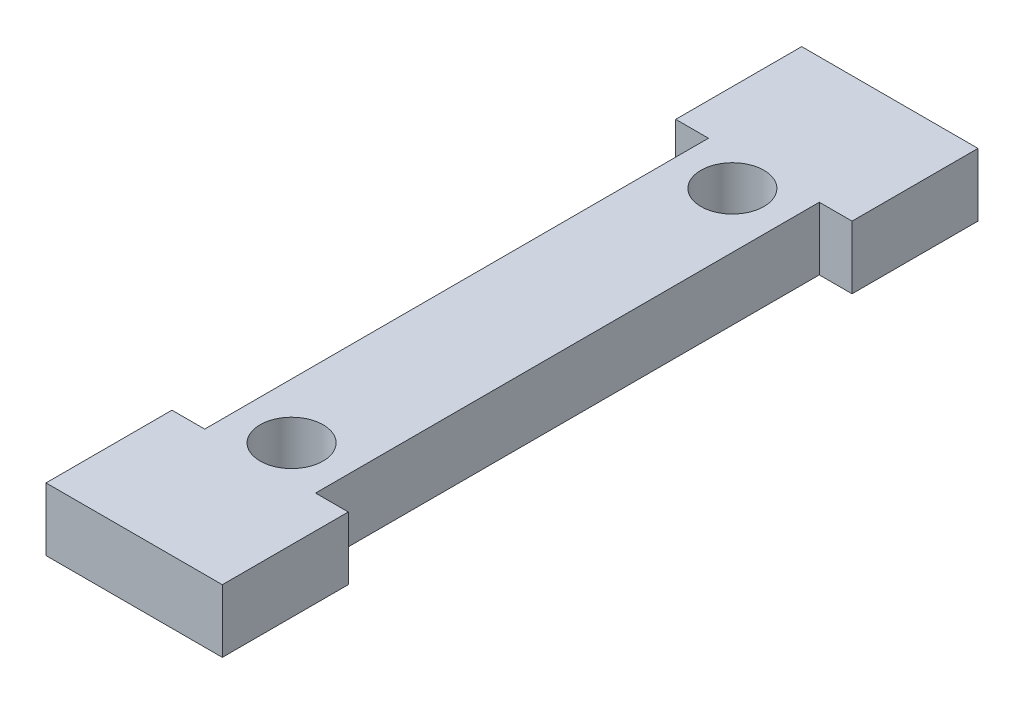
ISO-10303-21;
HEADER;
FILE_DESCRIPTION(('STEP AP214'),'2;1');
FILE_NAME('part.step','',(''),(''),'','','');
FILE_SCHEMA(('AUTOMOTIVE_DESIGN { 1 0 10303 214 1 1 1 1 }'));
ENDSEC;
DATA;
#1=APPLICATION_CONTEXT('core data for automotive mechanical design processes');
#2=APPLICATION_PROTOCOL_DEFINITION('international standard','automotive_design',2000,#1);
#3=PRODUCT_CONTEXT('',#1,'mechanical');
#4=PRODUCT('Part','Part','',(#3));
#5=PRODUCT_RELATED_PRODUCT_CATEGORY('part','',(#4));
#6=PRODUCT_DEFINITION_FORMATION('','',#4);
#7=PRODUCT_DEFINITION_CONTEXT('part definition',#1,'design');
#8=PRODUCT_DEFINITION('design','',#6,#7);
#9=PRODUCT_DEFINITION_SHAPE('','',#8);
#10=(LENGTH_UNIT() NAMED_UNIT(*) SI_UNIT(.MILLI.,.METRE.));
#11=(NAMED_UNIT(*) PLANE_ANGLE_UNIT() SI_UNIT($,.RADIAN.));
#12=(NAMED_UNIT(*) SI_UNIT($,.STERADIAN.) SOLID_ANGLE_UNIT());
#13=UNCERTAINTY_MEASURE_WITH_UNIT(LENGTH_MEASURE(1.E-05),#10,'distance_accuracy_value','');
#14=(GEOMETRIC_REPRESENTATION_CONTEXT(3) GLOBAL_UNCERTAINTY_ASSIGNED_CONTEXT((#13)) GLOBAL_UNIT_ASSIGNED_CONTEXT((#10,
#11,#12)) REPRESENTATION_CONTEXT('',''));
#15=CARTESIAN_POINT('',(0.,0.,0.));
#16=DIRECTION('',(0.,0.,1.));
#17=DIRECTION('',(1.,0.,0.));
#18=AXIS2_PLACEMENT_3D('',#15,#16,#17);
#19=CARTESIAN_POINT('',(0.,6.35,0.));
#20=DIRECTION('',(0.,0.,-1.));
#21=DIRECTION('',(-1.,0.,0.));
#22=AXIS2_PLACEMENT_3D('',#19,#20,#21);
#23=PLANE('',#22);
#24=DIRECTION('',(1.,0.,0.));
#25=VECTOR('',#24,1.);
#26=CARTESIAN_POINT('',(0.,0.,0.));
#27=LINE('',#26,#25);
#28=CARTESIAN_POINT('',(-3.30199999999999,0.,0.));
#29=VERTEX_POINT('',#28);
#30=CARTESIAN_POINT('',(14.478,0.,0.));
#31=VERTEX_POINT('',#30);
#32=EDGE_CURVE('E173',#29,#31,#27,.T.);
#33=ORIENTED_EDGE('',*,*,#32,.T.);
#34=DIRECTION('',(0.,-1.,0.));
#35=VECTOR('',#34,1.);
#36=CARTESIAN_POINT('',(14.478,6.35,0.));
#37=LINE('',#36,#35);
#38=CARTESIAN_POINT('',(14.478,6.35,0.));
#39=VERTEX_POINT('',#38);
#40=EDGE_CURVE('E11',#39,#31,#37,.T.);
#41=ORIENTED_EDGE('',*,*,#40,.F.);
#42=DIRECTION('',(1.,0.,0.));
#43=VECTOR('',#42,1.);
#44=CARTESIAN_POINT('',(0.,6.35,0.));
#45=LINE('',#44,#43);
#46=CARTESIAN_POINT('',(-3.30199999999999,6.35,0.));
#47=VERTEX_POINT('',#46);
#48=EDGE_CURVE('E266',#47,#39,#45,.T.);
#49=ORIENTED_EDGE('',*,*,#48,.F.);
#50=DIRECTION('',(0.,-1.,0.));
#51=VECTOR('',#50,1.);
#52=CARTESIAN_POINT('',(-3.30199999999999,6.35,0.));
#53=LINE('',#52,#51);
#54=EDGE_CURVE('E169',#47,#29,#53,.T.);
#55=ORIENTED_EDGE('',*,*,#54,.T.);
#56=EDGE_LOOP('',(#33,#41,#49,#55));
#57=FACE_BOUND('',#56,.T.);
#58=ADVANCED_FACE('F45',(#57),#23,.F.);
#59=CARTESIAN_POINT('',(14.478,6.35,0.));
#60=DIRECTION('',(-1.,0.,0.));
#61=DIRECTION('',(0.,0.,1.));
#62=AXIS2_PLACEMENT_3D('',#59,#60,#61);
#63=PLANE('',#62);
#64=DIRECTION('',(0.,0.,-1.));
#65=VECTOR('',#64,1.);
#66=CARTESIAN_POINT('',(14.478,0.,0.));
#67=LINE('',#66,#65);
#68=CARTESIAN_POINT('',(14.478,0.,-12.7));
#69=VERTEX_POINT('',#68);
#70=EDGE_CURVE('E176',#31,#69,#67,.T.);
#71=ORIENTED_EDGE('',*,*,#70,.T.);
#72=DIRECTION('',(0.,-1.,0.));
#73=VECTOR('',#72,1.);
#74=CARTESIAN_POINT('',(14.478,6.35,-12.7));
#75=LINE('',#74,#73);
#76=CARTESIAN_POINT('',(14.478,6.35,-12.7));
#77=VERTEX_POINT('',#76);
#78=EDGE_CURVE('E54',#77,#69,#75,.T.);
#79=ORIENTED_EDGE('',*,*,#78,.F.);
#80=DIRECTION('',(0.,0.,-1.));
#81=VECTOR('',#80,1.);
#82=CARTESIAN_POINT('',(14.478,6.35,0.));
#83=LINE('',#82,#81);
#84=EDGE_CURVE('E117',#39,#77,#83,.T.);
#85=ORIENTED_EDGE('',*,*,#84,.F.);
#86=ORIENTED_EDGE('',*,*,#40,.T.);
#87=EDGE_LOOP('',(#71,#79,#85,#86));
#88=FACE_BOUND('',#87,.T.);
#89=ADVANCED_FACE('F279',(#88),#63,.F.);
#90=CARTESIAN_POINT('',(0.,6.35,-12.7));
#91=DIRECTION('',(0.,0.,1.));
#92=DIRECTION('',(1.,0.,0.));
#93=AXIS2_PLACEMENT_3D('',#90,#91,#92);
#94=PLANE('',#93);
#95=DIRECTION('',(-1.,0.,0.));
#96=VECTOR('',#95,1.);
#97=CARTESIAN_POINT('',(0.,0.,-12.7));
#98=LINE('',#97,#96);
#99=CARTESIAN_POINT('',(11.176,0.,-12.7));
#100=VERTEX_POINT('',#99);
#101=EDGE_CURVE('E178',#69,#100,#98,.T.);
#102=ORIENTED_EDGE('',*,*,#101,.T.);
#103=DIRECTION('',(0.,-1.,0.));
#104=VECTOR('',#103,1.);
#105=CARTESIAN_POINT('',(11.176,6.35,-12.7));
#106=LINE('',#105,#104);
#107=CARTESIAN_POINT('',(11.176,6.35,-12.7));
#108=VERTEX_POINT('',#107);
#109=EDGE_CURVE('E217',#108,#100,#106,.T.);
#110=ORIENTED_EDGE('',*,*,#109,.F.);
#111=DIRECTION('',(-1.,0.,0.));
#112=VECTOR('',#111,1.);
#113=CARTESIAN_POINT('',(0.,6.35,-12.7));
#114=LINE('',#113,#112);
#115=EDGE_CURVE('E225',#77,#108,#114,.T.);
#116=ORIENTED_EDGE('',*,*,#115,.F.);
#117=ORIENTED_EDGE('',*,*,#78,.T.);
#118=EDGE_LOOP('',(#102,#110,#116,#117));
#119=FACE_BOUND('',#118,.T.);
#120=ADVANCED_FACE('F223',(#119),#94,.F.);
#121=CARTESIAN_POINT('',(11.176,6.35,0.));
#122=DIRECTION('',(-1.,0.,0.));
#123=DIRECTION('',(0.,0.,1.));
#124=AXIS2_PLACEMENT_3D('',#121,#122,#123);
#125=PLANE('',#124);
#126=DIRECTION('',(0.,0.,-1.));
#127=VECTOR('',#126,1.);
#128=CARTESIAN_POINT('',(11.176,0.,0.));
#129=LINE('',#128,#127);
#130=CARTESIAN_POINT('',(11.176,0.,-63.5));
#131=VERTEX_POINT('',#130);
#132=EDGE_CURVE('E180',#100,#131,#129,.T.);
#133=ORIENTED_EDGE('',*,*,#132,.T.);
#134=DIRECTION('',(0.,-1.,0.));
#135=VECTOR('',#134,1.);
#136=CARTESIAN_POINT('',(11.176,6.35,-63.5));
#137=LINE('',#136,#135);
#138=CARTESIAN_POINT('',(11.176,6.35,-63.5));
#139=VERTEX_POINT('',#138);
#140=EDGE_CURVE('E214',#139,#131,#137,.T.);
#141=ORIENTED_EDGE('',*,*,#140,.F.);
#142=DIRECTION('',(0.,0.,-1.));
#143=VECTOR('',#142,1.);
#144=CARTESIAN_POINT('',(11.176,6.35,0.));
#145=LINE('',#144,#143);
#146=EDGE_CURVE('E244',#108,#139,#145,.T.);
#147=ORIENTED_EDGE('',*,*,#146,.F.);
#148=ORIENTED_EDGE('',*,*,#109,.T.);
#149=EDGE_LOOP('',(#133,#141,#147,#148));
#150=FACE_BOUND('',#149,.T.);
#151=ADVANCED_FACE('F235',(#150),#125,.F.);
#152=CARTESIAN_POINT('',(0.,6.35,-63.5));
#153=DIRECTION('',(0.,0.,-1.));
#154=DIRECTION('',(-1.,0.,0.));
#155=AXIS2_PLACEMENT_3D('',#152,#153,#154);
#156=PLANE('',#155);
#157=DIRECTION('',(1.,0.,0.));
#158=VECTOR('',#157,1.);
#159=CARTESIAN_POINT('',(0.,0.,-63.5));
#160=LINE('',#159,#158);
#161=CARTESIAN_POINT('',(14.478,0.,-63.5));
#162=VERTEX_POINT('',#161);
#163=EDGE_CURVE('E182',#131,#162,#160,.T.);
#164=ORIENTED_EDGE('',*,*,#163,.T.);
#165=DIRECTION('',(0.,-1.,0.));
#166=VECTOR('',#165,1.);
#167=CARTESIAN_POINT('',(14.478,6.35,-63.5));
#168=LINE('',#167,#166);
#169=CARTESIAN_POINT('',(14.478,6.35,-63.5));
#170=VERTEX_POINT('',#169);
#171=EDGE_CURVE('E211',#170,#162,#168,.T.);
#172=ORIENTED_EDGE('',*,*,#171,.F.);
#173=DIRECTION('',(1.,0.,0.));
#174=VECTOR('',#173,1.);
#175=CARTESIAN_POINT('',(0.,6.35,-63.5));
#176=LINE('',#175,#174);
#177=EDGE_CURVE('E241',#139,#170,#176,.T.);
#178=ORIENTED_EDGE('',*,*,#177,.F.);
#179=ORIENTED_EDGE('',*,*,#140,.T.);
#180=EDGE_LOOP('',(#164,#172,#178,#179));
#181=FACE_BOUND('',#180,.T.);
#182=ADVANCED_FACE('F239',(#181),#156,.F.);
#183=CARTESIAN_POINT('',(14.478,6.35,0.));
#184=DIRECTION('',(-1.,0.,0.));
#185=DIRECTION('',(0.,0.,1.));
#186=AXIS2_PLACEMENT_3D('',#183,#184,#185);
#187=PLANE('',#186);
#188=DIRECTION('',(0.,0.,-1.));
#189=VECTOR('',#188,1.);
#190=CARTESIAN_POINT('',(14.478,0.,0.));
#191=LINE('',#190,#189);
#192=CARTESIAN_POINT('',(14.478,0.,-76.2));
#193=VERTEX_POINT('',#192);
#194=EDGE_CURVE('E184',#162,#193,#191,.T.);
#195=ORIENTED_EDGE('',*,*,#194,.T.);
#196=DIRECTION('',(0.,-1.,0.));
#197=VECTOR('',#196,1.);
#198=CARTESIAN_POINT('',(14.478,6.35,-76.2));
#199=LINE('',#198,#197);
#200=CARTESIAN_POINT('',(14.478,6.35,-76.2));
#201=VERTEX_POINT('',#200);
#202=EDGE_CURVE('E208',#201,#193,#199,.T.);
#203=ORIENTED_EDGE('',*,*,#202,.F.);
#204=DIRECTION('',(0.,0.,-1.));
#205=VECTOR('',#204,1.);
#206=CARTESIAN_POINT('',(14.478,6.35,0.));
#207=LINE('',#206,#205);
#208=EDGE_CURVE('E243',#170,#201,#207,.T.);
#209=ORIENTED_EDGE('',*,*,#208,.F.);
#210=ORIENTED_EDGE('',*,*,#171,.T.);
#211=EDGE_LOOP('',(#195,#203,#209,#210));
#212=FACE_BOUND('',#211,.T.);
#213=ADVANCED_FACE('F291',(#212),#187,.F.);
#214=CARTESIAN_POINT('',(0.,6.35,-76.2));
#215=DIRECTION('',(0.,0.,1.));
#216=DIRECTION('',(1.,0.,0.));
#217=AXIS2_PLACEMENT_3D('',#214,#215,#216);
#218=PLANE('',#217);
#219=DIRECTION('',(-1.,0.,0.));
#220=VECTOR('',#219,1.);
#221=CARTESIAN_POINT('',(0.,0.,-76.2));
#222=LINE('',#221,#220);
#223=CARTESIAN_POINT('',(-3.302,0.,-76.2));
#224=VERTEX_POINT('',#223);
#225=EDGE_CURVE('E186',#193,#224,#222,.T.);
#226=ORIENTED_EDGE('',*,*,#225,.T.);
#227=DIRECTION('',(0.,-1.,0.));
#228=VECTOR('',#227,1.);
#229=CARTESIAN_POINT('',(-3.302,6.35,-76.2));
#230=LINE('',#229,#228);
#231=CARTESIAN_POINT('',(-3.302,6.35,-76.2));
#232=VERTEX_POINT('',#231);
#233=EDGE_CURVE('E205',#232,#224,#230,.T.);
#234=ORIENTED_EDGE('',*,*,#233,.F.);
#235=DIRECTION('',(-1.,0.,0.));
#236=VECTOR('',#235,1.);
#237=CARTESIAN_POINT('',(0.,6.35,-76.2));
#238=LINE('',#237,#236);
#239=EDGE_CURVE('E246',#201,#232,#238,.T.);
#240=ORIENTED_EDGE('',*,*,#239,.F.);
#241=ORIENTED_EDGE('',*,*,#202,.T.);
#242=EDGE_LOOP('',(#226,#234,#240,#241));
#243=FACE_BOUND('',#242,.T.);
#244=ADVANCED_FACE('F294',(#243),#218,.F.);
#245=CARTESIAN_POINT('',(-3.30200000000001,6.35,0.));
#246=DIRECTION('',(1.,0.,0.));
#247=DIRECTION('',(0.,0.,-1.));
#248=AXIS2_PLACEMENT_3D('',#245,#246,#247);
#249=PLANE('',#248);
#250=DIRECTION('',(0.,0.,1.));
#251=VECTOR('',#250,1.);
#252=CARTESIAN_POINT('',(-3.30200000000001,0.,0.));
#253=LINE('',#252,#251);
#254=CARTESIAN_POINT('',(-3.302,0.,-63.5));
#255=VERTEX_POINT('',#254);
#256=EDGE_CURVE('E188',#224,#255,#253,.T.);
#257=ORIENTED_EDGE('',*,*,#256,.T.);
#258=DIRECTION('',(0.,-1.,0.));
#259=VECTOR('',#258,1.);
#260=CARTESIAN_POINT('',(-3.302,6.35,-63.5));
#261=LINE('',#260,#259);
#262=CARTESIAN_POINT('',(-3.302,6.35,-63.5));
#263=VERTEX_POINT('',#262);
#264=EDGE_CURVE('E202',#263,#255,#261,.T.);
#265=ORIENTED_EDGE('',*,*,#264,.F.);
#266=DIRECTION('',(0.,0.,1.));
#267=VECTOR('',#266,1.);
#268=CARTESIAN_POINT('',(-3.30200000000001,6.35,0.));
#269=LINE('',#268,#267);
#270=EDGE_CURVE('E252',#232,#263,#269,.T.);
#271=ORIENTED_EDGE('',*,*,#270,.F.);
#272=ORIENTED_EDGE('',*,*,#233,.T.);
#273=EDGE_LOOP('',(#257,#265,#271,#272));
#274=FACE_BOUND('',#273,.T.);
#275=ADVANCED_FACE('F258',(#274),#249,.F.);
#276=CARTESIAN_POINT('',(0.,6.35,-63.5));
#277=DIRECTION('',(0.,0.,-1.));
#278=DIRECTION('',(-1.,0.,0.));
#279=AXIS2_PLACEMENT_3D('',#276,#277,#278);
#280=PLANE('',#279);
#281=DIRECTION('',(1.,0.,0.));
#282=VECTOR('',#281,1.);
#283=CARTESIAN_POINT('',(0.,0.,-63.5));
#284=LINE('',#283,#282);
#285=CARTESIAN_POINT('',(0.,0.,-63.5));
#286=VERTEX_POINT('',#285);
#287=EDGE_CURVE('E190',#255,#286,#284,.T.);
#288=ORIENTED_EDGE('',*,*,#287,.T.);
#289=DIRECTION('',(0.,-1.,0.));
#290=VECTOR('',#289,1.);
#291=CARTESIAN_POINT('',(0.,6.35,-63.5));
#292=LINE('',#291,#290);
#293=CARTESIAN_POINT('',(0.,6.35,-63.5));
#294=VERTEX_POINT('',#293);
#295=EDGE_CURVE('E158',#294,#286,#292,.T.);
#296=ORIENTED_EDGE('',*,*,#295,.F.);
#297=DIRECTION('',(1.,0.,0.));
#298=VECTOR('',#297,1.);
#299=CARTESIAN_POINT('',(0.,6.35,-63.5));
#300=LINE('',#299,#298);
#301=EDGE_CURVE('E149',#263,#294,#300,.T.);
#302=ORIENTED_EDGE('',*,*,#301,.F.);
#303=ORIENTED_EDGE('',*,*,#264,.T.);
#304=EDGE_LOOP('',(#288,#296,#302,#303));
#305=FACE_BOUND('',#304,.T.);
#306=ADVANCED_FACE('F262',(#305),#280,.F.);
#307=CARTESIAN_POINT('',(0.,6.35,0.));
#308=DIRECTION('',(1.,0.,0.));
#309=DIRECTION('',(0.,0.,-1.));
#310=AXIS2_PLACEMENT_3D('',#307,#308,#309);
#311=PLANE('',#310);
#312=DIRECTION('',(0.,0.,1.));
#313=VECTOR('',#312,1.);
#314=CARTESIAN_POINT('',(0.,0.,0.));
#315=LINE('',#314,#313);
#316=CARTESIAN_POINT('',(0.,0.,-12.7));
#317=VERTEX_POINT('',#316);
#318=EDGE_CURVE('E157',#286,#317,#315,.T.);
#319=ORIENTED_EDGE('',*,*,#318,.T.);
#320=DIRECTION('',(0.,-1.,0.));
#321=VECTOR('',#320,1.);
#322=CARTESIAN_POINT('',(0.,6.35,-12.7));
#323=LINE('',#322,#321);
#324=CARTESIAN_POINT('',(0.,6.35,-12.7));
#325=VERTEX_POINT('',#324);
#326=EDGE_CURVE('E154',#325,#317,#323,.T.);
#327=ORIENTED_EDGE('',*,*,#326,.F.);
#328=DIRECTION('',(0.,0.,1.));
#329=VECTOR('',#328,1.);
#330=CARTESIAN_POINT('',(0.,6.35,0.));
#331=LINE('',#330,#329);
#332=EDGE_CURVE('E142',#294,#325,#331,.T.);
#333=ORIENTED_EDGE('',*,*,#332,.F.);
#334=ORIENTED_EDGE('',*,*,#295,.T.);
#335=EDGE_LOOP('',(#319,#327,#333,#334));
#336=FACE_BOUND('',#335,.T.);
#337=ADVANCED_FACE('F155',(#336),#311,.F.);
#338=CARTESIAN_POINT('',(0.,6.35,-12.7));
#339=DIRECTION('',(0.,0.,1.));
#340=DIRECTION('',(1.,0.,0.));
#341=AXIS2_PLACEMENT_3D('',#338,#339,#340);
#342=PLANE('',#341);
#343=DIRECTION('',(-1.,0.,0.));
#344=VECTOR('',#343,1.);
#345=CARTESIAN_POINT('',(0.,0.,-12.7));
#346=LINE('',#345,#344);
#347=CARTESIAN_POINT('',(-3.30199999999999,0.,-12.7));
#348=VERTEX_POINT('',#347);
#349=EDGE_CURVE('E103',#317,#348,#346,.T.);
#350=ORIENTED_EDGE('',*,*,#349,.T.);
#351=DIRECTION('',(0.,-1.,0.));
#352=VECTOR('',#351,1.);
#353=CARTESIAN_POINT('',(-3.30199999999999,6.35,-12.7));
#354=LINE('',#353,#352);
#355=CARTESIAN_POINT('',(-3.30199999999999,6.35,-12.7));
#356=VERTEX_POINT('',#355);
#357=EDGE_CURVE('E159',#356,#348,#354,.T.);
#358=ORIENTED_EDGE('',*,*,#357,.F.);
#359=DIRECTION('',(-1.,0.,0.));
#360=VECTOR('',#359,1.);
#361=CARTESIAN_POINT('',(0.,6.35,-12.7));
#362=LINE('',#361,#360);
#363=EDGE_CURVE('E147',#325,#356,#362,.T.);
#364=ORIENTED_EDGE('',*,*,#363,.F.);
#365=ORIENTED_EDGE('',*,*,#326,.T.);
#366=EDGE_LOOP('',(#350,#358,#364,#365));
#367=FACE_BOUND('',#366,.T.);
#368=ADVANCED_FACE('F161',(#367),#342,.F.);
#369=CARTESIAN_POINT('',(-3.30199999999999,6.35,0.));
#370=DIRECTION('',(1.,0.,0.));
#371=DIRECTION('',(0.,0.,-1.));
#372=AXIS2_PLACEMENT_3D('',#369,#370,#371);
#373=PLANE('',#372);
#374=DIRECTION('',(0.,0.,1.));
#375=VECTOR('',#374,1.);
#376=CARTESIAN_POINT('',(-3.30199999999999,0.,0.));
#377=LINE('',#376,#375);
#378=EDGE_CURVE('E109',#348,#29,#377,.T.);
#379=ORIENTED_EDGE('',*,*,#378,.T.);
#380=ORIENTED_EDGE('',*,*,#54,.F.);
#381=DIRECTION('',(0.,0.,1.));
#382=VECTOR('',#381,1.);
#383=CARTESIAN_POINT('',(-3.30199999999999,6.35,0.));
#384=LINE('',#383,#382);
#385=EDGE_CURVE('E62',#356,#47,#384,.T.);
#386=ORIENTED_EDGE('',*,*,#385,.F.);
#387=ORIENTED_EDGE('',*,*,#357,.T.);
#388=EDGE_LOOP('',(#379,#380,#386,#387));
#389=FACE_BOUND('',#388,.T.);
#390=ADVANCED_FACE('F267',(#389),#373,.F.);
#391=CARTESIAN_POINT('',(5.588,6.35,-60.325));
#392=DIRECTION('',(0.,-1.,0.));
#393=DIRECTION('',(0.,0.,-1.));
#394=AXIS2_PLACEMENT_3D('',#391,#392,#393);
#395=CYLINDRICAL_SURFACE('',#394,3.175);
#396=CARTESIAN_POINT('',(5.588,6.35,-60.325));
#397=DIRECTION('',(0.,1.,0.));
#398=DIRECTION('',(0.,0.,1.));
#399=AXIS2_PLACEMENT_3D('',#396,#397,#398);
#400=CIRCLE('',#399,3.175);
#401=CARTESIAN_POINT('',(5.588,6.35,-57.15));
#402=VERTEX_POINT('',#401);
#403=EDGE_CURVE('E198',#402,#402,#400,.T.);
#404=ORIENTED_EDGE('',*,*,#403,.T.);
#405=EDGE_LOOP('',(#404));
#406=FACE_BOUND('',#405,.T.);
#407=CARTESIAN_POINT('',(5.588,0.,-60.325));
#408=DIRECTION('',(0.,1.,0.));
#409=DIRECTION('',(0.,0.,1.));
#410=AXIS2_PLACEMENT_3D('',#407,#408,#409);
#411=CIRCLE('',#410,3.175);
#412=CARTESIAN_POINT('',(5.588,0.,-57.15));
#413=VERTEX_POINT('',#412);
#414=EDGE_CURVE('E170',#413,#413,#411,.T.);
#415=ORIENTED_EDGE('',*,*,#414,.F.);
#416=EDGE_LOOP('',(#415));
#417=FACE_BOUND('',#416,.T.);
#418=ADVANCED_FACE('F47',(#406,#417),#395,.F.);
#419=CARTESIAN_POINT('',(5.588,6.35,-15.875));
#420=DIRECTION('',(0.,-1.,0.));
#421=DIRECTION('',(0.,0.,-1.));
#422=AXIS2_PLACEMENT_3D('',#419,#420,#421);
#423=CYLINDRICAL_SURFACE('',#422,3.175);
#424=CARTESIAN_POINT('',(5.588,6.35,-15.875));
#425=DIRECTION('',(0.,1.,0.));
#426=DIRECTION('',(0.,0.,1.));
#427=AXIS2_PLACEMENT_3D('',#424,#425,#426);
#428=CIRCLE('',#427,3.175);
#429=CARTESIAN_POINT('',(5.588,6.35,-12.7));
#430=VERTEX_POINT('',#429);
#431=EDGE_CURVE('E163',#430,#430,#428,.T.);
#432=ORIENTED_EDGE('',*,*,#431,.T.);
#433=EDGE_LOOP('',(#432));
#434=FACE_BOUND('',#433,.T.);
#435=CARTESIAN_POINT('',(5.588,0.,-15.875));
#436=DIRECTION('',(0.,1.,0.));
#437=DIRECTION('',(0.,0.,1.));
#438=AXIS2_PLACEMENT_3D('',#435,#436,#437);
#439=CIRCLE('',#438,3.175);
#440=CARTESIAN_POINT('',(5.588,0.,-12.7));
#441=VERTEX_POINT('',#440);
#442=EDGE_CURVE('E195',#441,#441,#439,.T.);
#443=ORIENTED_EDGE('',*,*,#442,.F.);
#444=EDGE_LOOP('',(#443));
#445=FACE_BOUND('',#444,.T.);
#446=ADVANCED_FACE('F274',(#434,#445),#423,.F.);
#447=CARTESIAN_POINT('',(0.,6.35,0.));
#448=DIRECTION('',(0.,1.,0.));
#449=DIRECTION('',(0.,0.,1.));
#450=AXIS2_PLACEMENT_3D('',#447,#448,#449);
#451=PLANE('',#450);
#452=ORIENTED_EDGE('',*,*,#403,.F.);
#453=EDGE_LOOP('',(#452));
#454=FACE_BOUND('',#453,.T.);
#455=ORIENTED_EDGE('',*,*,#48,.T.);
#456=ORIENTED_EDGE('',*,*,#84,.T.);
#457=ORIENTED_EDGE('',*,*,#115,.T.);
#458=ORIENTED_EDGE('',*,*,#146,.T.);
#459=ORIENTED_EDGE('',*,*,#177,.T.);
#460=ORIENTED_EDGE('',*,*,#208,.T.);
#461=ORIENTED_EDGE('',*,*,#239,.T.);
#462=ORIENTED_EDGE('',*,*,#270,.T.);
#463=ORIENTED_EDGE('',*,*,#301,.T.);
#464=ORIENTED_EDGE('',*,*,#332,.T.);
#465=ORIENTED_EDGE('',*,*,#363,.T.);
#466=ORIENTED_EDGE('',*,*,#385,.T.);
#467=EDGE_LOOP('',(#455,#456,#457,#458,#459,#460,#461,#462,#463,#464,#465,#466));
#468=FACE_BOUND('',#467,.T.);
#469=ORIENTED_EDGE('',*,*,#431,.F.);
#470=EDGE_LOOP('',(#469));
#471=FACE_BOUND('',#470,.T.);
#472=ADVANCED_FACE('F144',(#454,#468,#471),#451,.T.);
#473=CARTESIAN_POINT('',(0.,0.,0.));
#474=DIRECTION('',(0.,1.,0.));
#475=DIRECTION('',(0.,0.,1.));
#476=AXIS2_PLACEMENT_3D('',#473,#474,#475);
#477=PLANE('',#476);
#478=ORIENTED_EDGE('',*,*,#414,.T.);
#479=EDGE_LOOP('',(#478));
#480=FACE_BOUND('',#479,.T.);
#481=ORIENTED_EDGE('',*,*,#32,.F.);
#482=ORIENTED_EDGE('',*,*,#378,.F.);
#483=ORIENTED_EDGE('',*,*,#349,.F.);
#484=ORIENTED_EDGE('',*,*,#318,.F.);
#485=ORIENTED_EDGE('',*,*,#287,.F.);
#486=ORIENTED_EDGE('',*,*,#256,.F.);
#487=ORIENTED_EDGE('',*,*,#225,.F.);
#488=ORIENTED_EDGE('',*,*,#194,.F.);
#489=ORIENTED_EDGE('',*,*,#163,.F.);
#490=ORIENTED_EDGE('',*,*,#132,.F.);
#491=ORIENTED_EDGE('',*,*,#101,.F.);
#492=ORIENTED_EDGE('',*,*,#70,.F.);
#493=EDGE_LOOP('',(#481,#482,#483,#484,#485,#486,#487,#488,#489,#490,#491,#492));
#494=FACE_BOUND('',#493,.T.);
#495=ORIENTED_EDGE('',*,*,#442,.T.);
#496=EDGE_LOOP('',(#495));
#497=FACE_BOUND('',#496,.T.);
#498=ADVANCED_FACE('F229',(#480,#494,#497),#477,.F.);
#499=CLOSED_SHELL('',(#58,#89,#120,#151,#182,#213,#244,#275,#306,#337,#368,#390,#418,#446,#472,#498));
#500=MANIFOLD_SOLID_BREP('B2',#499);
#501=ADVANCED_BREP_SHAPE_REPRESENTATION('',(#18,#500),#14);
#502=SHAPE_DEFINITION_REPRESENTATION(#9,#501);
ENDSEC;
END-ISO-10303-21;
